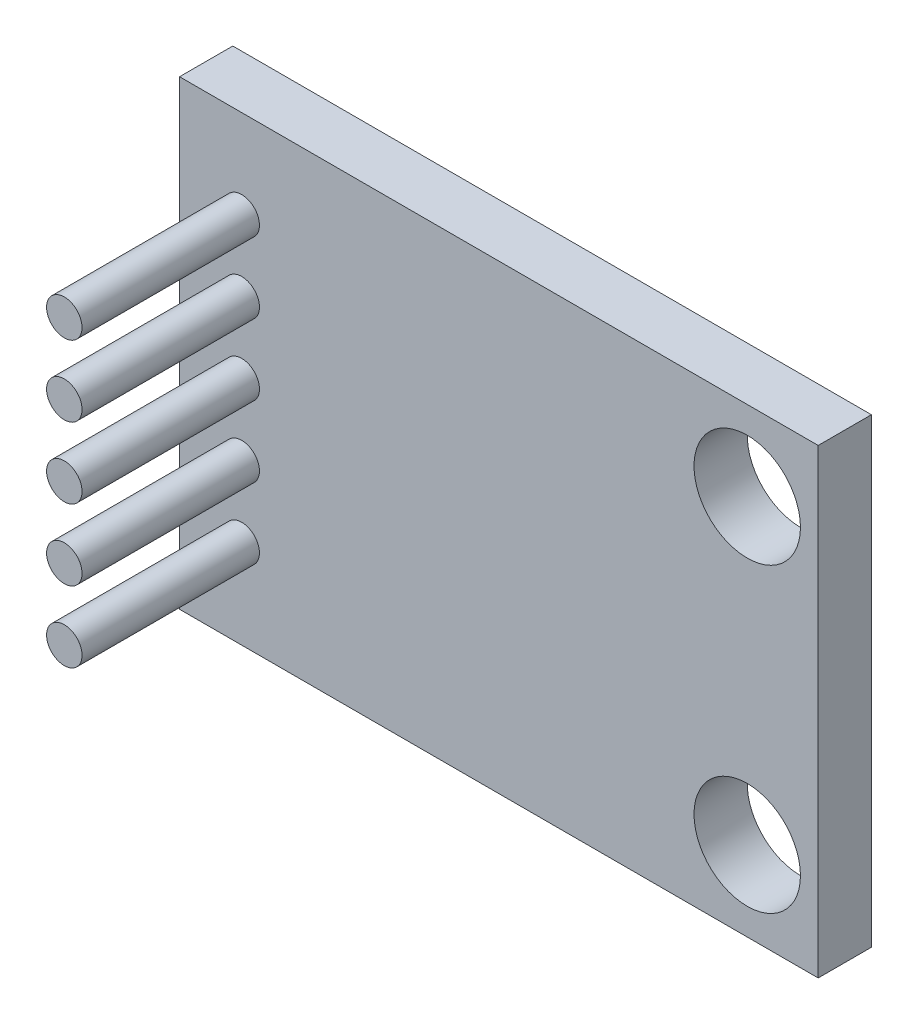
ISO-10303-21;
HEADER;
FILE_DESCRIPTION(('STEP AP214'),'2;1');
FILE_NAME('part.step','',(''),(''),'','','');
FILE_SCHEMA(('AUTOMOTIVE_DESIGN { 1 0 10303 214 1 1 1 1 }'));
ENDSEC;
DATA;
#1=APPLICATION_CONTEXT('core data for automotive mechanical design processes');
#2=APPLICATION_PROTOCOL_DEFINITION('international standard','automotive_design',2000,#1);
#3=PRODUCT_CONTEXT('',#1,'mechanical');
#4=PRODUCT('Part','Part','',(#3));
#5=PRODUCT_RELATED_PRODUCT_CATEGORY('part','',(#4));
#6=PRODUCT_DEFINITION_FORMATION('','',#4);
#7=PRODUCT_DEFINITION_CONTEXT('part definition',#1,'design');
#8=PRODUCT_DEFINITION('design','',#6,#7);
#9=PRODUCT_DEFINITION_SHAPE('','',#8);
#10=(LENGTH_UNIT() NAMED_UNIT(*) SI_UNIT(.MILLI.,.METRE.));
#11=(NAMED_UNIT(*) PLANE_ANGLE_UNIT() SI_UNIT($,.RADIAN.));
#12=(NAMED_UNIT(*) SI_UNIT($,.STERADIAN.) SOLID_ANGLE_UNIT());
#13=UNCERTAINTY_MEASURE_WITH_UNIT(LENGTH_MEASURE(1.E-05),#10,'distance_accuracy_value','');
#14=(GEOMETRIC_REPRESENTATION_CONTEXT(3) GLOBAL_UNCERTAINTY_ASSIGNED_CONTEXT((#13)) GLOBAL_UNIT_ASSIGNED_CONTEXT((#10,
#11,#12)) REPRESENTATION_CONTEXT('',''));
#15=CARTESIAN_POINT('',(0.,0.,0.));
#16=DIRECTION('',(0.,0.,1.));
#17=DIRECTION('',(1.,0.,0.));
#18=AXIS2_PLACEMENT_3D('',#15,#16,#17);
#19=CARTESIAN_POINT('',(156.583059713969,59.807197021668,1.5));
#20=DIRECTION('',(1.,0.,0.));
#21=DIRECTION('',(0.,0.,-1.));
#22=AXIS2_PLACEMENT_3D('',#19,#20,#21);
#23=PLANE('',#22);
#24=DIRECTION('',(0.,-1.,0.));
#25=VECTOR('',#24,1.);
#26=CARTESIAN_POINT('',(156.583059713969,59.807197021668,0.));
#27=LINE('',#26,#25);
#28=CARTESIAN_POINT('',(156.583059713969,59.807197021668,0.));
#29=VERTEX_POINT('',#28);
#30=CARTESIAN_POINT('',(156.583059713969,46.807197021668,0.));
#31=VERTEX_POINT('',#30);
#32=EDGE_CURVE('E99',#29,#31,#27,.T.);
#33=ORIENTED_EDGE('',*,*,#32,.T.);
#34=DIRECTION('',(0.,0.,-1.));
#35=VECTOR('',#34,1.);
#36=CARTESIAN_POINT('',(156.583059713969,46.807197021668,1.5));
#37=LINE('',#36,#35);
#38=CARTESIAN_POINT('',(156.583059713969,46.807197021668,1.5));
#39=VERTEX_POINT('',#38);
#40=EDGE_CURVE('E11',#39,#31,#37,.T.);
#41=ORIENTED_EDGE('',*,*,#40,.F.);
#42=DIRECTION('',(0.,-1.,0.));
#43=VECTOR('',#42,1.);
#44=CARTESIAN_POINT('',(156.583059713969,59.807197021668,1.5));
#45=LINE('',#44,#43);
#46=CARTESIAN_POINT('',(156.583059713969,59.807197021668,1.5));
#47=VERTEX_POINT('',#46);
#48=EDGE_CURVE('E86',#47,#39,#45,.T.);
#49=ORIENTED_EDGE('',*,*,#48,.F.);
#50=DIRECTION('',(0.,0.,-1.));
#51=VECTOR('',#50,1.);
#52=CARTESIAN_POINT('',(156.583059713969,59.807197021668,1.5));
#53=LINE('',#52,#51);
#54=EDGE_CURVE('E95',#47,#29,#53,.T.);
#55=ORIENTED_EDGE('',*,*,#54,.T.);
#56=EDGE_LOOP('',(#33,#41,#49,#55));
#57=FACE_BOUND('',#56,.T.);
#58=ADVANCED_FACE('F33',(#57),#23,.F.);
#59=CARTESIAN_POINT('',(156.583059713969,46.807197021668,1.5));
#60=DIRECTION('',(0.,1.,0.));
#61=DIRECTION('',(0.,0.,1.));
#62=AXIS2_PLACEMENT_3D('',#59,#60,#61);
#63=PLANE('',#62);
#64=DIRECTION('',(1.,0.,0.));
#65=VECTOR('',#64,1.);
#66=CARTESIAN_POINT('',(156.583059713969,46.807197021668,0.));
#67=LINE('',#66,#65);
#68=CARTESIAN_POINT('',(174.583059713969,46.807197021668,0.));
#69=VERTEX_POINT('',#68);
#70=EDGE_CURVE('E90',#31,#69,#67,.T.);
#71=ORIENTED_EDGE('',*,*,#70,.T.);
#72=DIRECTION('',(0.,0.,-1.));
#73=VECTOR('',#72,1.);
#74=CARTESIAN_POINT('',(174.583059713969,46.807197021668,1.5));
#75=LINE('',#74,#73);
#76=CARTESIAN_POINT('',(174.583059713969,46.807197021668,1.5));
#77=VERTEX_POINT('',#76);
#78=EDGE_CURVE('E42',#77,#69,#75,.T.);
#79=ORIENTED_EDGE('',*,*,#78,.F.);
#80=DIRECTION('',(1.,0.,0.));
#81=VECTOR('',#80,1.);
#82=CARTESIAN_POINT('',(156.583059713969,46.807197021668,1.5));
#83=LINE('',#82,#81);
#84=EDGE_CURVE('E81',#39,#77,#83,.T.);
#85=ORIENTED_EDGE('',*,*,#84,.F.);
#86=ORIENTED_EDGE('',*,*,#40,.T.);
#87=EDGE_LOOP('',(#71,#79,#85,#86));
#88=FACE_BOUND('',#87,.T.);
#89=ADVANCED_FACE('F89',(#88),#63,.F.);
#90=CARTESIAN_POINT('',(174.583059713969,59.807197021668,1.5));
#91=DIRECTION('',(-1.,0.,0.));
#92=DIRECTION('',(0.,0.,1.));
#93=AXIS2_PLACEMENT_3D('',#90,#91,#92);
#94=PLANE('',#93);
#95=DIRECTION('',(0.,1.,0.));
#96=VECTOR('',#95,1.);
#97=CARTESIAN_POINT('',(174.583059713969,59.807197021668,0.));
#98=LINE('',#97,#96);
#99=CARTESIAN_POINT('',(174.583059713969,59.807197021668,0.));
#100=VERTEX_POINT('',#99);
#101=EDGE_CURVE('E68',#69,#100,#98,.T.);
#102=ORIENTED_EDGE('',*,*,#101,.T.);
#103=DIRECTION('',(0.,0.,-1.));
#104=VECTOR('',#103,1.);
#105=CARTESIAN_POINT('',(174.583059713969,59.807197021668,1.5));
#106=LINE('',#105,#104);
#107=CARTESIAN_POINT('',(174.583059713969,59.807197021668,1.5));
#108=VERTEX_POINT('',#107);
#109=EDGE_CURVE('E91',#108,#100,#106,.T.);
#110=ORIENTED_EDGE('',*,*,#109,.F.);
#111=DIRECTION('',(0.,1.,0.));
#112=VECTOR('',#111,1.);
#113=CARTESIAN_POINT('',(174.583059713969,59.807197021668,1.5));
#114=LINE('',#113,#112);
#115=EDGE_CURVE('E84',#77,#108,#114,.T.);
#116=ORIENTED_EDGE('',*,*,#115,.F.);
#117=ORIENTED_EDGE('',*,*,#78,.T.);
#118=EDGE_LOOP('',(#102,#110,#116,#117));
#119=FACE_BOUND('',#118,.T.);
#120=ADVANCED_FACE('F93',(#119),#94,.F.);
#121=CARTESIAN_POINT('',(156.583059713969,59.807197021668,1.5));
#122=DIRECTION('',(0.,-1.,0.));
#123=DIRECTION('',(0.,0.,-1.));
#124=AXIS2_PLACEMENT_3D('',#121,#122,#123);
#125=PLANE('',#124);
#126=DIRECTION('',(-1.,0.,0.));
#127=VECTOR('',#126,1.);
#128=CARTESIAN_POINT('',(156.583059713969,59.807197021668,0.));
#129=LINE('',#128,#127);
#130=EDGE_CURVE('E74',#100,#29,#129,.T.);
#131=ORIENTED_EDGE('',*,*,#130,.T.);
#132=ORIENTED_EDGE('',*,*,#54,.F.);
#133=DIRECTION('',(-1.,0.,0.));
#134=VECTOR('',#133,1.);
#135=CARTESIAN_POINT('',(156.583059713969,59.807197021668,1.5));
#136=LINE('',#135,#134);
#137=EDGE_CURVE('E51',#108,#47,#136,.T.);
#138=ORIENTED_EDGE('',*,*,#137,.F.);
#139=ORIENTED_EDGE('',*,*,#109,.T.);
#140=EDGE_LOOP('',(#131,#132,#138,#139));
#141=FACE_BOUND('',#140,.T.);
#142=ADVANCED_FACE('F155',(#141),#125,.F.);
#143=CARTESIAN_POINT('',(0.,0.,1.5));
#144=DIRECTION('',(0.,0.,1.));
#145=DIRECTION('',(1.,0.,0.));
#146=AXIS2_PLACEMENT_3D('',#143,#144,#145);
#147=PLANE('',#146);
#148=CARTESIAN_POINT('',(172.583059713969,57.557197021668,1.5));
#149=DIRECTION('',(0.,0.,1.));
#150=DIRECTION('',(1.,0.,0.));
#151=AXIS2_PLACEMENT_3D('',#148,#149,#150);
#152=CIRCLE('',#151,1.5);
#153=CARTESIAN_POINT('',(174.083059713969,57.557197021668,1.5));
#154=VERTEX_POINT('',#153);
#155=EDGE_CURVE('E109',#154,#154,#152,.T.);
#156=ORIENTED_EDGE('',*,*,#155,.F.);
#157=EDGE_LOOP('',(#156));
#158=FACE_BOUND('',#157,.T.);
#159=CARTESIAN_POINT('',(172.583059713969,49.057197021668,1.5));
#160=DIRECTION('',(0.,0.,1.));
#161=DIRECTION('',(-1.,0.,0.));
#162=AXIS2_PLACEMENT_3D('',#159,#160,#161);
#163=CIRCLE('',#162,1.5);
#164=CARTESIAN_POINT('',(171.083059713969,49.057197021668,1.5));
#165=VERTEX_POINT('',#164);
#166=EDGE_CURVE('E115',#165,#165,#163,.T.);
#167=ORIENTED_EDGE('',*,*,#166,.F.);
#168=EDGE_LOOP('',(#167));
#169=FACE_BOUND('',#168,.T.);
#170=CARTESIAN_POINT('',(158.334176002424,49.307197021668,1.5));
#171=DIRECTION('',(0.,0.,1.));
#172=DIRECTION('',(1.,0.,0.));
#173=AXIS2_PLACEMENT_3D('',#170,#171,#172);
#174=CIRCLE('',#173,0.499999999999999);
#175=CARTESIAN_POINT('',(158.834176002424,49.307197021668,1.5));
#176=VERTEX_POINT('',#175);
#177=EDGE_CURVE('E113',#176,#176,#174,.T.);
#178=ORIENTED_EDGE('',*,*,#177,.F.);
#179=EDGE_LOOP('',(#178));
#180=FACE_BOUND('',#179,.T.);
#181=CARTESIAN_POINT('',(158.334176002424,51.307197021668,1.5));
#182=DIRECTION('',(0.,0.,1.));
#183=DIRECTION('',(1.,0.,0.));
#184=AXIS2_PLACEMENT_3D('',#181,#182,#183);
#185=CIRCLE('',#184,0.499999999999999);
#186=CARTESIAN_POINT('',(158.834176002424,51.307197021668,1.5));
#187=VERTEX_POINT('',#186);
#188=EDGE_CURVE('E125',#187,#187,#185,.T.);
#189=ORIENTED_EDGE('',*,*,#188,.F.);
#190=EDGE_LOOP('',(#189));
#191=FACE_BOUND('',#190,.T.);
#192=CARTESIAN_POINT('',(158.334176002424,57.307197021668,1.5));
#193=DIRECTION('',(0.,0.,1.));
#194=DIRECTION('',(1.,0.,0.));
#195=AXIS2_PLACEMENT_3D('',#192,#193,#194);
#196=CIRCLE('',#195,0.499999999999999);
#197=CARTESIAN_POINT('',(158.834176002424,57.307197021668,1.5));
#198=VERTEX_POINT('',#197);
#199=EDGE_CURVE('E131',#198,#198,#196,.T.);
#200=ORIENTED_EDGE('',*,*,#199,.F.);
#201=EDGE_LOOP('',(#200));
#202=FACE_BOUND('',#201,.T.);
#203=CARTESIAN_POINT('',(158.334176002424,55.307197021668,1.5));
#204=DIRECTION('',(0.,0.,1.));
#205=DIRECTION('',(1.,0.,0.));
#206=AXIS2_PLACEMENT_3D('',#203,#204,#205);
#207=CIRCLE('',#206,0.499999999999999);
#208=CARTESIAN_POINT('',(158.834176002424,55.307197021668,1.5));
#209=VERTEX_POINT('',#208);
#210=EDGE_CURVE('E137',#209,#209,#207,.T.);
#211=ORIENTED_EDGE('',*,*,#210,.F.);
#212=EDGE_LOOP('',(#211));
#213=FACE_BOUND('',#212,.T.);
#214=CARTESIAN_POINT('',(158.334176002424,53.307197021668,1.5));
#215=DIRECTION('',(0.,0.,1.));
#216=DIRECTION('',(1.,0.,0.));
#217=AXIS2_PLACEMENT_3D('',#214,#215,#216);
#218=CIRCLE('',#217,0.499999999999999);
#219=CARTESIAN_POINT('',(158.834176002424,53.307197021668,1.5));
#220=VERTEX_POINT('',#219);
#221=EDGE_CURVE('E143',#220,#220,#218,.T.);
#222=ORIENTED_EDGE('',*,*,#221,.F.);
#223=EDGE_LOOP('',(#222));
#224=FACE_BOUND('',#223,.T.);
#225=ORIENTED_EDGE('',*,*,#48,.T.);
#226=ORIENTED_EDGE('',*,*,#84,.T.);
#227=ORIENTED_EDGE('',*,*,#115,.T.);
#228=ORIENTED_EDGE('',*,*,#137,.T.);
#229=EDGE_LOOP('',(#225,#226,#227,#228));
#230=FACE_BOUND('',#229,.T.);
#231=ADVANCED_FACE('F82',(#158,#169,#180,#191,#202,#213,#224,#230),#147,.T.);
#232=CARTESIAN_POINT('',(0.,0.,0.));
#233=DIRECTION('',(0.,0.,1.));
#234=DIRECTION('',(1.,0.,0.));
#235=AXIS2_PLACEMENT_3D('',#232,#233,#234);
#236=PLANE('',#235);
#237=CARTESIAN_POINT('',(172.583059713969,57.557197021668,0.));
#238=DIRECTION('',(0.,0.,1.));
#239=DIRECTION('',(1.,0.,0.));
#240=AXIS2_PLACEMENT_3D('',#237,#238,#239);
#241=CIRCLE('',#240,1.5);
#242=CARTESIAN_POINT('',(174.083059713969,57.557197021668,0.));
#243=VERTEX_POINT('',#242);
#244=EDGE_CURVE('E36',#243,#243,#241,.T.);
#245=ORIENTED_EDGE('',*,*,#244,.T.);
#246=EDGE_LOOP('',(#245));
#247=FACE_BOUND('',#246,.T.);
#248=CARTESIAN_POINT('',(172.583059713969,49.057197021668,0.));
#249=DIRECTION('',(0.,0.,1.));
#250=DIRECTION('',(1.,0.,0.));
#251=AXIS2_PLACEMENT_3D('',#248,#249,#250);
#252=CIRCLE('',#251,1.5);
#253=CARTESIAN_POINT('',(174.083059713969,49.057197021668,0.));
#254=VERTEX_POINT('',#253);
#255=EDGE_CURVE('E107',#254,#254,#252,.T.);
#256=ORIENTED_EDGE('',*,*,#255,.T.);
#257=EDGE_LOOP('',(#256));
#258=FACE_BOUND('',#257,.T.);
#259=ORIENTED_EDGE('',*,*,#32,.F.);
#260=ORIENTED_EDGE('',*,*,#130,.F.);
#261=ORIENTED_EDGE('',*,*,#101,.F.);
#262=ORIENTED_EDGE('',*,*,#70,.F.);
#263=EDGE_LOOP('',(#259,#260,#261,#262));
#264=FACE_BOUND('',#263,.T.);
#265=ADVANCED_FACE('F154',(#247,#258,#264),#236,.F.);
#266=CARTESIAN_POINT('',(158.334176002424,53.307197021668,6.5));
#267=DIRECTION('',(0.,0.,-1.));
#268=DIRECTION('',(-1.,0.,0.));
#269=AXIS2_PLACEMENT_3D('',#266,#267,#268);
#270=CYLINDRICAL_SURFACE('',#269,0.499999999999999);
#271=CARTESIAN_POINT('',(158.334176002424,53.307197021668,6.5));
#272=DIRECTION('',(0.,0.,1.));
#273=DIRECTION('',(1.,0.,0.));
#274=AXIS2_PLACEMENT_3D('',#271,#272,#273);
#275=CIRCLE('',#274,0.499999999999999);
#276=CARTESIAN_POINT('',(158.834176002424,53.307197021668,6.5));
#277=VERTEX_POINT('',#276);
#278=EDGE_CURVE('E102',#277,#277,#275,.T.);
#279=ORIENTED_EDGE('',*,*,#278,.F.);
#280=EDGE_LOOP('',(#279));
#281=FACE_BOUND('',#280,.T.);
#282=ORIENTED_EDGE('',*,*,#221,.T.);
#283=EDGE_LOOP('',(#282));
#284=FACE_BOUND('',#283,.T.);
#285=ADVANCED_FACE('F151',(#281,#284),#270,.T.);
#286=CARTESIAN_POINT('',(158.334176002424,53.307197021668,6.5));
#287=DIRECTION('',(0.,0.,1.));
#288=DIRECTION('',(1.,0.,0.));
#289=AXIS2_PLACEMENT_3D('',#286,#287,#288);
#290=PLANE('',#289);
#291=ORIENTED_EDGE('',*,*,#278,.T.);
#292=EDGE_LOOP('',(#291));
#293=FACE_BOUND('',#292,.T.);
#294=ADVANCED_FACE('F194',(#293),#290,.T.);
#295=CARTESIAN_POINT('',(158.334176002424,55.307197021668,6.5));
#296=DIRECTION('',(0.,0.,-1.));
#297=DIRECTION('',(-1.,0.,0.));
#298=AXIS2_PLACEMENT_3D('',#295,#296,#297);
#299=CYLINDRICAL_SURFACE('',#298,0.499999999999999);
#300=CARTESIAN_POINT('',(158.334176002424,55.307197021668,6.5));
#301=DIRECTION('',(0.,0.,1.));
#302=DIRECTION('',(1.,0.,0.));
#303=AXIS2_PLACEMENT_3D('',#300,#301,#302);
#304=CIRCLE('',#303,0.499999999999999);
#305=CARTESIAN_POINT('',(158.834176002424,55.307197021668,6.5));
#306=VERTEX_POINT('',#305);
#307=EDGE_CURVE('E140',#306,#306,#304,.T.);
#308=ORIENTED_EDGE('',*,*,#307,.F.);
#309=EDGE_LOOP('',(#308));
#310=FACE_BOUND('',#309,.T.);
#311=ORIENTED_EDGE('',*,*,#210,.T.);
#312=EDGE_LOOP('',(#311));
#313=FACE_BOUND('',#312,.T.);
#314=ADVANCED_FACE('F204',(#310,#313),#299,.T.);
#315=CARTESIAN_POINT('',(158.334176002424,55.307197021668,6.5));
#316=DIRECTION('',(0.,0.,1.));
#317=DIRECTION('',(1.,0.,0.));
#318=AXIS2_PLACEMENT_3D('',#315,#316,#317);
#319=PLANE('',#318);
#320=ORIENTED_EDGE('',*,*,#307,.T.);
#321=EDGE_LOOP('',(#320));
#322=FACE_BOUND('',#321,.T.);
#323=ADVANCED_FACE('F214',(#322),#319,.T.);
#324=CARTESIAN_POINT('',(158.334176002424,57.307197021668,6.5));
#325=DIRECTION('',(0.,0.,-1.));
#326=DIRECTION('',(-1.,0.,0.));
#327=AXIS2_PLACEMENT_3D('',#324,#325,#326);
#328=CYLINDRICAL_SURFACE('',#327,0.499999999999999);
#329=CARTESIAN_POINT('',(158.334176002424,57.307197021668,6.5));
#330=DIRECTION('',(0.,0.,1.));
#331=DIRECTION('',(1.,0.,0.));
#332=AXIS2_PLACEMENT_3D('',#329,#330,#331);
#333=CIRCLE('',#332,0.499999999999999);
#334=CARTESIAN_POINT('',(158.834176002424,57.307197021668,6.5));
#335=VERTEX_POINT('',#334);
#336=EDGE_CURVE('E134',#335,#335,#333,.T.);
#337=ORIENTED_EDGE('',*,*,#336,.F.);
#338=EDGE_LOOP('',(#337));
#339=FACE_BOUND('',#338,.T.);
#340=ORIENTED_EDGE('',*,*,#199,.T.);
#341=EDGE_LOOP('',(#340));
#342=FACE_BOUND('',#341,.T.);
#343=ADVANCED_FACE('F224',(#339,#342),#328,.T.);
#344=CARTESIAN_POINT('',(158.334176002424,57.307197021668,6.5));
#345=DIRECTION('',(0.,0.,1.));
#346=DIRECTION('',(1.,0.,0.));
#347=AXIS2_PLACEMENT_3D('',#344,#345,#346);
#348=PLANE('',#347);
#349=ORIENTED_EDGE('',*,*,#336,.T.);
#350=EDGE_LOOP('',(#349));
#351=FACE_BOUND('',#350,.T.);
#352=ADVANCED_FACE('F234',(#351),#348,.T.);
#353=CARTESIAN_POINT('',(158.334176002424,51.307197021668,6.5));
#354=DIRECTION('',(0.,0.,-1.));
#355=DIRECTION('',(-1.,0.,0.));
#356=AXIS2_PLACEMENT_3D('',#353,#354,#355);
#357=CYLINDRICAL_SURFACE('',#356,0.499999999999999);
#358=CARTESIAN_POINT('',(158.334176002424,51.307197021668,6.5));
#359=DIRECTION('',(0.,0.,1.));
#360=DIRECTION('',(1.,0.,0.));
#361=AXIS2_PLACEMENT_3D('',#358,#359,#360);
#362=CIRCLE('',#361,0.499999999999999);
#363=CARTESIAN_POINT('',(158.834176002424,51.307197021668,6.5));
#364=VERTEX_POINT('',#363);
#365=EDGE_CURVE('E128',#364,#364,#362,.T.);
#366=ORIENTED_EDGE('',*,*,#365,.F.);
#367=EDGE_LOOP('',(#366));
#368=FACE_BOUND('',#367,.T.);
#369=ORIENTED_EDGE('',*,*,#188,.T.);
#370=EDGE_LOOP('',(#369));
#371=FACE_BOUND('',#370,.T.);
#372=ADVANCED_FACE('F244',(#368,#371),#357,.T.);
#373=CARTESIAN_POINT('',(158.334176002424,51.307197021668,6.5));
#374=DIRECTION('',(0.,0.,1.));
#375=DIRECTION('',(1.,0.,0.));
#376=AXIS2_PLACEMENT_3D('',#373,#374,#375);
#377=PLANE('',#376);
#378=ORIENTED_EDGE('',*,*,#365,.T.);
#379=EDGE_LOOP('',(#378));
#380=FACE_BOUND('',#379,.T.);
#381=ADVANCED_FACE('F254',(#380),#377,.T.);
#382=CARTESIAN_POINT('',(158.334176002424,49.307197021668,6.5));
#383=DIRECTION('',(0.,0.,-1.));
#384=DIRECTION('',(-1.,0.,0.));
#385=AXIS2_PLACEMENT_3D('',#382,#383,#384);
#386=CYLINDRICAL_SURFACE('',#385,0.499999999999999);
#387=CARTESIAN_POINT('',(158.334176002424,49.307197021668,6.5));
#388=DIRECTION('',(0.,0.,1.));
#389=DIRECTION('',(1.,0.,0.));
#390=AXIS2_PLACEMENT_3D('',#387,#388,#389);
#391=CIRCLE('',#390,0.499999999999999);
#392=CARTESIAN_POINT('',(158.834176002424,49.307197021668,6.5));
#393=VERTEX_POINT('',#392);
#394=EDGE_CURVE('E122',#393,#393,#391,.T.);
#395=ORIENTED_EDGE('',*,*,#394,.F.);
#396=EDGE_LOOP('',(#395));
#397=FACE_BOUND('',#396,.T.);
#398=ORIENTED_EDGE('',*,*,#177,.T.);
#399=EDGE_LOOP('',(#398));
#400=FACE_BOUND('',#399,.T.);
#401=ADVANCED_FACE('F264',(#397,#400),#386,.T.);
#402=CARTESIAN_POINT('',(158.334176002424,49.307197021668,6.5));
#403=DIRECTION('',(0.,0.,1.));
#404=DIRECTION('',(1.,0.,0.));
#405=AXIS2_PLACEMENT_3D('',#402,#403,#404);
#406=PLANE('',#405);
#407=ORIENTED_EDGE('',*,*,#394,.T.);
#408=EDGE_LOOP('',(#407));
#409=FACE_BOUND('',#408,.T.);
#410=ADVANCED_FACE('F274',(#409),#406,.T.);
#411=CARTESIAN_POINT('',(172.583059713969,49.057197021668,-6.24264068711927));
#412=DIRECTION('',(0.,0.,1.));
#413=DIRECTION('',(1.,0.,0.));
#414=AXIS2_PLACEMENT_3D('',#411,#412,#413);
#415=CYLINDRICAL_SURFACE('',#414,1.5);
#416=ORIENTED_EDGE('',*,*,#166,.T.);
#417=EDGE_LOOP('',(#416));
#418=FACE_BOUND('',#417,.T.);
#419=ORIENTED_EDGE('',*,*,#255,.F.);
#420=EDGE_LOOP('',(#419));
#421=FACE_BOUND('',#420,.T.);
#422=ADVANCED_FACE('F283',(#418,#421),#415,.F.);
#423=CARTESIAN_POINT('',(172.583059713969,57.557197021668,-6.24264068711927));
#424=DIRECTION('',(0.,0.,1.));
#425=DIRECTION('',(1.,0.,0.));
#426=AXIS2_PLACEMENT_3D('',#423,#424,#425);
#427=CYLINDRICAL_SURFACE('',#426,1.5);
#428=ORIENTED_EDGE('',*,*,#155,.T.);
#429=EDGE_LOOP('',(#428));
#430=FACE_BOUND('',#429,.T.);
#431=ORIENTED_EDGE('',*,*,#244,.F.);
#432=EDGE_LOOP('',(#431));
#433=FACE_BOUND('',#432,.T.);
#434=ADVANCED_FACE('F302',(#430,#433),#427,.F.);
#435=CLOSED_SHELL('',(#58,#89,#120,#142,#231,#265,#285,#294,#314,#323,#343,#352,#372,#381,#401,
#410,#422,#434));
#436=MANIFOLD_SOLID_BREP('B2',#435);
#437=ADVANCED_BREP_SHAPE_REPRESENTATION('',(#18,#436),#14);
#438=SHAPE_DEFINITION_REPRESENTATION(#9,#437);
ENDSEC;
END-ISO-10303-21;
